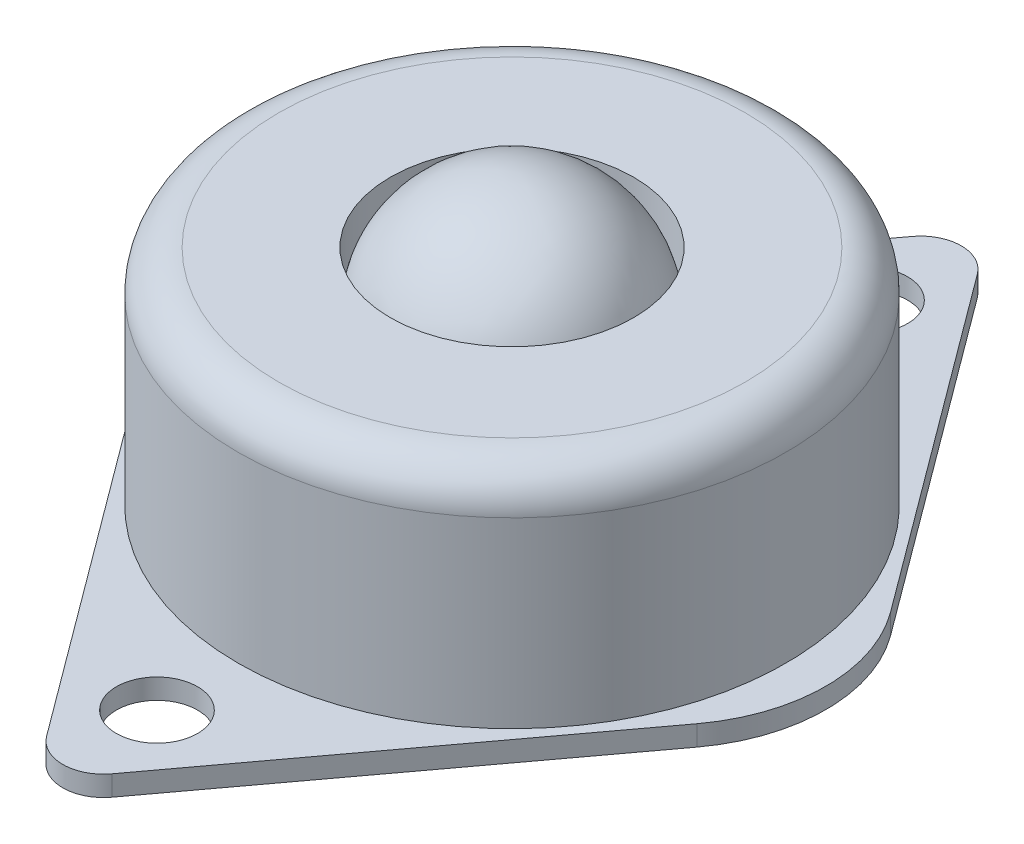
ISO-10303-21;
HEADER;
FILE_DESCRIPTION(('STEP AP214'),'2;1');
FILE_NAME('part.step','',(''),(''),'','','');
FILE_SCHEMA(('AUTOMOTIVE_DESIGN { 1 0 10303 214 1 1 1 1 }'));
ENDSEC;
DATA;
#1=APPLICATION_CONTEXT('core data for automotive mechanical design processes');
#2=APPLICATION_PROTOCOL_DEFINITION('international standard','automotive_design',2000,#1);
#3=PRODUCT_CONTEXT('',#1,'mechanical');
#4=PRODUCT('Part','Part','',(#3));
#5=PRODUCT_RELATED_PRODUCT_CATEGORY('part','',(#4));
#6=PRODUCT_DEFINITION_FORMATION('','',#4);
#7=PRODUCT_DEFINITION_CONTEXT('part definition',#1,'design');
#8=PRODUCT_DEFINITION('design','',#6,#7);
#9=PRODUCT_DEFINITION_SHAPE('','',#8);
#10=(LENGTH_UNIT() NAMED_UNIT(*) SI_UNIT(.MILLI.,.METRE.));
#11=(NAMED_UNIT(*) PLANE_ANGLE_UNIT() SI_UNIT($,.RADIAN.));
#12=(NAMED_UNIT(*) SI_UNIT($,.STERADIAN.) SOLID_ANGLE_UNIT());
#13=UNCERTAINTY_MEASURE_WITH_UNIT(LENGTH_MEASURE(1.E-05),#10,'distance_accuracy_value','');
#14=(GEOMETRIC_REPRESENTATION_CONTEXT(3) GLOBAL_UNCERTAINTY_ASSIGNED_CONTEXT((#13)) GLOBAL_UNIT_ASSIGNED_CONTEXT((#10,
#11,#12)) REPRESENTATION_CONTEXT('',''));
#15=CARTESIAN_POINT('',(0.,0.,0.));
#16=DIRECTION('',(0.,0.,1.));
#17=DIRECTION('',(1.,0.,0.));
#18=AXIS2_PLACEMENT_3D('',#15,#16,#17);
#19=CARTESIAN_POINT('',(0.,9.,0.));
#20=DIRECTION('',(-1.,0.,0.));
#21=DIRECTION('',(0.,0.,-1.));
#22=AXIS2_PLACEMENT_3D('',#19,#20,#21);
#23=SPHERICAL_SURFACE('',#22,6.);
#24=CARTESIAN_POINT('',(-6.,9.,0.));
#25=VERTEX_POINT('',#24);
#26=VERTEX_LOOP('',#25);
#27=FACE_BOUND('',#26,.T.);
#28=ADVANCED_FACE('F42',(#27),#23,.T.);
#29=CLOSED_SHELL('',(#28));
#30=MANIFOLD_SOLID_BREP('B2',#29);
#31=CARTESIAN_POINT('',(0.,10.,0.));
#32=DIRECTION('',(0.,1.,0.));
#33=DIRECTION('',(0.,0.,1.));
#34=AXIS2_PLACEMENT_3D('',#31,#32,#33);
#35=TOROIDAL_SURFACE('',#34,11.5,2.);
#36=CARTESIAN_POINT('',(0.,12.,0.));
#37=DIRECTION('',(0.,1.,0.));
#38=DIRECTION('',(0.,0.,1.));
#39=AXIS2_PLACEMENT_3D('',#36,#37,#38);
#40=CIRCLE('',#39,11.5);
#41=CARTESIAN_POINT('',(0.,12.,11.5));
#42=VERTEX_POINT('',#41);
#43=EDGE_CURVE('E65',#42,#42,#40,.T.);
#44=ORIENTED_EDGE('',*,*,#43,.F.);
#45=EDGE_LOOP('',(#44));
#46=FACE_BOUND('',#45,.T.);
#47=CARTESIAN_POINT('',(0.,10.,0.));
#48=DIRECTION('',(0.,1.,0.));
#49=DIRECTION('',(0.,0.,1.));
#50=AXIS2_PLACEMENT_3D('',#47,#48,#49);
#51=CIRCLE('',#50,13.5);
#52=CARTESIAN_POINT('',(0.,10.,13.5));
#53=VERTEX_POINT('',#52);
#54=EDGE_CURVE('E40',#53,#53,#51,.F.);
#55=ORIENTED_EDGE('',*,*,#54,.F.);
#56=EDGE_LOOP('',(#55));
#57=FACE_BOUND('',#56,.T.);
#58=ADVANCED_FACE('F57',(#46,#57),#35,.T.);
#59=CARTESIAN_POINT('',(11.2444342652969,1.,-8.34042553191489));
#60=DIRECTION('',(0.803173876092633,0.,-0.595744680851064));
#61=DIRECTION('',(-0.595744680851064,0.,-0.803173876092633));
#62=AXIS2_PLACEMENT_3D('',#59,#60,#61);
#63=PLANE('',#62);
#64=DIRECTION('',(0.595744680851064,0.,0.803173876092633));
#65=VECTOR('',#64,1.);
#66=CARTESIAN_POINT('',(11.2444342652969,0.,-8.34042553191489));
#67=LINE('',#66,#65);
#68=CARTESIAN_POINT('',(1.60634775218528,0.,-21.3343465045593));
#69=VERTEX_POINT('',#68);
#70=CARTESIAN_POINT('',(13.8957535025879,0.,-4.76595744680855));
#71=VERTEX_POINT('',#70);
#72=EDGE_CURVE('E159',#69,#71,#67,.T.);
#73=ORIENTED_EDGE('',*,*,#72,.F.);
#74=DIRECTION('',(0.,-1.,0.));
#75=VECTOR('',#74,1.);
#76=CARTESIAN_POINT('',(1.60634775218528,1.,-21.3343465045593));
#77=LINE('',#76,#75);
#78=CARTESIAN_POINT('',(1.60634775218528,1.,-21.3343465045593));
#79=VERTEX_POINT('',#78);
#80=EDGE_CURVE('E112',#79,#69,#77,.T.);
#81=ORIENTED_EDGE('',*,*,#80,.F.);
#82=DIRECTION('',(0.595744680851064,0.,0.803173876092633));
#83=VECTOR('',#82,1.);
#84=CARTESIAN_POINT('',(11.2444342652969,1.,-8.34042553191489));
#85=LINE('',#84,#83);
#86=CARTESIAN_POINT('',(13.8957535025879,1.,-4.76595744680855));
#87=VERTEX_POINT('',#86);
#88=EDGE_CURVE('E225',#79,#87,#85,.T.);
#89=ORIENTED_EDGE('',*,*,#88,.T.);
#90=DIRECTION('',(0.,-1.,0.));
#91=VECTOR('',#90,1.);
#92=CARTESIAN_POINT('',(13.8957535025879,1.,-4.76595744680855));
#93=LINE('',#92,#91);
#94=EDGE_CURVE('E108',#87,#71,#93,.T.);
#95=ORIENTED_EDGE('',*,*,#94,.T.);
#96=EDGE_LOOP('',(#73,#81,#89,#95));
#97=FACE_BOUND('',#96,.T.);
#98=ADVANCED_FACE('F207',(#97),#63,.T.);
#99=CARTESIAN_POINT('',(0.,1.,-20.1428571428571));
#100=DIRECTION('',(0.,-1.,0.));
#101=DIRECTION('',(0.,0.,-1.));
#102=AXIS2_PLACEMENT_3D('',#99,#100,#101);
#103=CYLINDRICAL_SURFACE('',#102,2.);
#104=CARTESIAN_POINT('',(0.,0.,-20.1428571428571));
#105=DIRECTION('',(0.,1.,0.));
#106=DIRECTION('',(0.,0.,1.));
#107=AXIS2_PLACEMENT_3D('',#104,#105,#106);
#108=CIRCLE('',#107,2.);
#109=CARTESIAN_POINT('',(-1.60634775218528,0.,-21.3343465045593));
#110=VERTEX_POINT('',#109);
#111=EDGE_CURVE('E163',#69,#110,#108,.T.);
#112=ORIENTED_EDGE('',*,*,#111,.T.);
#113=DIRECTION('',(0.,-1.,0.));
#114=VECTOR('',#113,1.);
#115=CARTESIAN_POINT('',(-1.60634775218528,1.,-21.3343465045593));
#116=LINE('',#115,#114);
#117=CARTESIAN_POINT('',(-1.60634775218528,1.,-21.3343465045593));
#118=VERTEX_POINT('',#117);
#119=EDGE_CURVE('E193',#118,#110,#116,.T.);
#120=ORIENTED_EDGE('',*,*,#119,.F.);
#121=CARTESIAN_POINT('',(0.,1.,-20.1428571428571));
#122=DIRECTION('',(0.,1.,0.));
#123=DIRECTION('',(0.,0.,1.));
#124=AXIS2_PLACEMENT_3D('',#121,#122,#123);
#125=CIRCLE('',#124,2.);
#126=EDGE_CURVE('E227',#79,#118,#125,.T.);
#127=ORIENTED_EDGE('',*,*,#126,.F.);
#128=ORIENTED_EDGE('',*,*,#80,.T.);
#129=EDGE_LOOP('',(#112,#120,#127,#128));
#130=FACE_BOUND('',#129,.T.);
#131=ADVANCED_FACE('F247',(#130),#103,.T.);
#132=CARTESIAN_POINT('',(-11.2444342652969,1.,-8.34042553191489));
#133=DIRECTION('',(0.803173876092633,0.,0.595744680851064));
#134=DIRECTION('',(0.595744680851064,0.,-0.803173876092633));
#135=AXIS2_PLACEMENT_3D('',#132,#133,#134);
#136=PLANE('',#135);
#137=DIRECTION('',(-0.595744680851064,0.,0.803173876092633));
#138=VECTOR('',#137,1.);
#139=CARTESIAN_POINT('',(-11.2444342652969,0.,-8.34042553191489));
#140=LINE('',#139,#138);
#141=CARTESIAN_POINT('',(-13.8957535025879,0.,-4.76595744680854));
#142=VERTEX_POINT('',#141);
#143=EDGE_CURVE('E166',#110,#142,#140,.T.);
#144=ORIENTED_EDGE('',*,*,#143,.T.);
#145=DIRECTION('',(0.,-1.,0.));
#146=VECTOR('',#145,1.);
#147=CARTESIAN_POINT('',(-13.8957535025879,1.,-4.76595744680854));
#148=LINE('',#147,#146);
#149=CARTESIAN_POINT('',(-13.8957535025879,1.,-4.76595744680854));
#150=VERTEX_POINT('',#149);
#151=EDGE_CURVE('E190',#150,#142,#148,.T.);
#152=ORIENTED_EDGE('',*,*,#151,.F.);
#153=DIRECTION('',(-0.595744680851064,0.,0.803173876092633));
#154=VECTOR('',#153,1.);
#155=CARTESIAN_POINT('',(-11.2444342652969,1.,-8.34042553191489));
#156=LINE('',#155,#154);
#157=EDGE_CURVE('E230',#118,#150,#156,.T.);
#158=ORIENTED_EDGE('',*,*,#157,.F.);
#159=ORIENTED_EDGE('',*,*,#119,.T.);
#160=EDGE_LOOP('',(#144,#152,#158,#159));
#161=FACE_BOUND('',#160,.T.);
#162=ADVANCED_FACE('F249',(#161),#136,.F.);
#163=CARTESIAN_POINT('',(-7.47036249384684,1.,0.));
#164=DIRECTION('',(0.,-1.,0.));
#165=DIRECTION('',(0.,0.,-1.));
#166=AXIS2_PLACEMENT_3D('',#163,#164,#165);
#167=CYLINDRICAL_SURFACE('',#166,8.);
#168=CARTESIAN_POINT('',(-7.47036249384684,0.,0.));
#169=DIRECTION('',(0.,1.,0.));
#170=DIRECTION('',(0.,0.,1.));
#171=AXIS2_PLACEMENT_3D('',#168,#169,#170);
#172=CIRCLE('',#171,8.);
#173=CARTESIAN_POINT('',(-13.8957535025879,0.,4.76595744680854));
#174=VERTEX_POINT('',#173);
#175=EDGE_CURVE('E169',#142,#174,#172,.T.);
#176=ORIENTED_EDGE('',*,*,#175,.T.);
#177=DIRECTION('',(0.,-1.,0.));
#178=VECTOR('',#177,1.);
#179=CARTESIAN_POINT('',(-13.8957535025879,1.,4.76595744680854));
#180=LINE('',#179,#178);
#181=CARTESIAN_POINT('',(-13.8957535025879,1.,4.76595744680854));
#182=VERTEX_POINT('',#181);
#183=EDGE_CURVE('E187',#182,#174,#180,.T.);
#184=ORIENTED_EDGE('',*,*,#183,.F.);
#185=CARTESIAN_POINT('',(-7.47036249384684,1.,0.));
#186=DIRECTION('',(0.,1.,0.));
#187=DIRECTION('',(0.,0.,1.));
#188=AXIS2_PLACEMENT_3D('',#185,#186,#187);
#189=CIRCLE('',#188,8.);
#190=EDGE_CURVE('E233',#150,#182,#189,.T.);
#191=ORIENTED_EDGE('',*,*,#190,.F.);
#192=ORIENTED_EDGE('',*,*,#151,.T.);
#193=EDGE_LOOP('',(#176,#184,#191,#192));
#194=FACE_BOUND('',#193,.T.);
#195=ADVANCED_FACE('F237',(#194),#167,.T.);
#196=CARTESIAN_POINT('',(-11.2444342652969,1.,8.34042553191489));
#197=DIRECTION('',(0.803173876092633,0.,-0.595744680851064));
#198=DIRECTION('',(-0.595744680851064,0.,-0.803173876092633));
#199=AXIS2_PLACEMENT_3D('',#196,#197,#198);
#200=PLANE('',#199);
#201=DIRECTION('',(0.595744680851064,0.,0.803173876092633));
#202=VECTOR('',#201,1.);
#203=CARTESIAN_POINT('',(-11.2444342652969,0.,8.34042553191489));
#204=LINE('',#203,#202);
#205=CARTESIAN_POINT('',(-1.60634775218528,0.,21.3343465045593));
#206=VERTEX_POINT('',#205);
#207=EDGE_CURVE('E172',#174,#206,#204,.T.);
#208=ORIENTED_EDGE('',*,*,#207,.T.);
#209=DIRECTION('',(0.,-1.,0.));
#210=VECTOR('',#209,1.);
#211=CARTESIAN_POINT('',(-1.60634775218528,1.,21.3343465045593));
#212=LINE('',#211,#210);
#213=CARTESIAN_POINT('',(-1.60634775218528,1.,21.3343465045593));
#214=VERTEX_POINT('',#213);
#215=EDGE_CURVE('E146',#214,#206,#212,.T.);
#216=ORIENTED_EDGE('',*,*,#215,.F.);
#217=DIRECTION('',(0.595744680851064,0.,0.803173876092633));
#218=VECTOR('',#217,1.);
#219=CARTESIAN_POINT('',(-11.2444342652969,1.,8.34042553191489));
#220=LINE('',#219,#218);
#221=EDGE_CURVE('E134',#182,#214,#220,.T.);
#222=ORIENTED_EDGE('',*,*,#221,.F.);
#223=ORIENTED_EDGE('',*,*,#183,.T.);
#224=EDGE_LOOP('',(#208,#216,#222,#223));
#225=FACE_BOUND('',#224,.T.);
#226=ADVANCED_FACE('F239',(#225),#200,.F.);
#227=CARTESIAN_POINT('',(0.,1.,20.1428571428571));
#228=DIRECTION('',(0.,-1.,0.));
#229=DIRECTION('',(0.,0.,-1.));
#230=AXIS2_PLACEMENT_3D('',#227,#228,#229);
#231=CYLINDRICAL_SURFACE('',#230,2.);
#232=CARTESIAN_POINT('',(0.,0.,20.1428571428571));
#233=DIRECTION('',(0.,1.,0.));
#234=DIRECTION('',(0.,0.,1.));
#235=AXIS2_PLACEMENT_3D('',#232,#233,#234);
#236=CIRCLE('',#235,2.);
#237=CARTESIAN_POINT('',(1.60634775218528,0.,21.3343465045593));
#238=VERTEX_POINT('',#237);
#239=EDGE_CURVE('E142',#206,#238,#236,.T.);
#240=ORIENTED_EDGE('',*,*,#239,.T.);
#241=DIRECTION('',(0.,-1.,0.));
#242=VECTOR('',#241,1.);
#243=CARTESIAN_POINT('',(1.60634775218528,1.,21.3343465045593));
#244=LINE('',#243,#242);
#245=CARTESIAN_POINT('',(1.60634775218528,1.,21.3343465045593));
#246=VERTEX_POINT('',#245);
#247=EDGE_CURVE('E140',#246,#238,#244,.T.);
#248=ORIENTED_EDGE('',*,*,#247,.F.);
#249=CARTESIAN_POINT('',(0.,1.,20.1428571428571));
#250=DIRECTION('',(0.,1.,0.));
#251=DIRECTION('',(0.,0.,1.));
#252=AXIS2_PLACEMENT_3D('',#249,#250,#251);
#253=CIRCLE('',#252,2.);
#254=EDGE_CURVE('E127',#214,#246,#253,.T.);
#255=ORIENTED_EDGE('',*,*,#254,.F.);
#256=ORIENTED_EDGE('',*,*,#215,.T.);
#257=EDGE_LOOP('',(#240,#248,#255,#256));
#258=FACE_BOUND('',#257,.T.);
#259=ADVANCED_FACE('F141',(#258),#231,.T.);
#260=CARTESIAN_POINT('',(11.2444342652969,1.,8.34042553191488));
#261=DIRECTION('',(0.803173876092633,0.,0.595744680851063));
#262=DIRECTION('',(0.595744680851063,0.,-0.803173876092633));
#263=AXIS2_PLACEMENT_3D('',#260,#261,#262);
#264=PLANE('',#263);
#265=DIRECTION('',(-0.595744680851063,0.,0.803173876092633));
#266=VECTOR('',#265,1.);
#267=CARTESIAN_POINT('',(11.2444342652969,0.,8.34042553191488));
#268=LINE('',#267,#266);
#269=CARTESIAN_POINT('',(13.8957535025879,0.,4.76595744680854));
#270=VERTEX_POINT('',#269);
#271=EDGE_CURVE('E176',#270,#238,#268,.T.);
#272=ORIENTED_EDGE('',*,*,#271,.F.);
#273=DIRECTION('',(0.,-1.,0.));
#274=VECTOR('',#273,1.);
#275=CARTESIAN_POINT('',(13.8957535025879,1.,4.76595744680854));
#276=LINE('',#275,#274);
#277=CARTESIAN_POINT('',(13.8957535025879,1.,4.76595744680854));
#278=VERTEX_POINT('',#277);
#279=EDGE_CURVE('E101',#278,#270,#276,.T.);
#280=ORIENTED_EDGE('',*,*,#279,.F.);
#281=DIRECTION('',(-0.595744680851063,0.,0.803173876092633));
#282=VECTOR('',#281,1.);
#283=CARTESIAN_POINT('',(11.2444342652969,1.,8.34042553191488));
#284=LINE('',#283,#282);
#285=EDGE_CURVE('E132',#278,#246,#284,.T.);
#286=ORIENTED_EDGE('',*,*,#285,.T.);
#287=ORIENTED_EDGE('',*,*,#247,.T.);
#288=EDGE_LOOP('',(#272,#280,#286,#287));
#289=FACE_BOUND('',#288,.T.);
#290=ADVANCED_FACE('F148',(#289),#264,.T.);
#291=CARTESIAN_POINT('',(7.47036249384684,1.,0.));
#292=DIRECTION('',(0.,-1.,0.));
#293=DIRECTION('',(0.,0.,-1.));
#294=AXIS2_PLACEMENT_3D('',#291,#292,#293);
#295=CYLINDRICAL_SURFACE('',#294,8.);
#296=CARTESIAN_POINT('',(7.47036249384684,0.,0.));
#297=DIRECTION('',(0.,1.,0.));
#298=DIRECTION('',(0.,0.,1.));
#299=AXIS2_PLACEMENT_3D('',#296,#297,#298);
#300=CIRCLE('',#299,8.);
#301=EDGE_CURVE('E178',#270,#71,#300,.T.);
#302=ORIENTED_EDGE('',*,*,#301,.T.);
#303=ORIENTED_EDGE('',*,*,#94,.F.);
#304=CARTESIAN_POINT('',(7.47036249384684,1.,0.));
#305=DIRECTION('',(0.,1.,0.));
#306=DIRECTION('',(0.,0.,1.));
#307=AXIS2_PLACEMENT_3D('',#304,#305,#306);
#308=CIRCLE('',#307,8.);
#309=EDGE_CURVE('E73',#278,#87,#308,.T.);
#310=ORIENTED_EDGE('',*,*,#309,.F.);
#311=ORIENTED_EDGE('',*,*,#279,.T.);
#312=EDGE_LOOP('',(#302,#303,#310,#311));
#313=FACE_BOUND('',#312,.T.);
#314=ADVANCED_FACE('F244',(#313),#295,.T.);
#315=CARTESIAN_POINT('',(0.,1.,-17.5));
#316=DIRECTION('',(0.,-1.,0.));
#317=DIRECTION('',(0.,0.,-1.));
#318=AXIS2_PLACEMENT_3D('',#315,#316,#317);
#319=CYLINDRICAL_SURFACE('',#318,2.);
#320=CARTESIAN_POINT('',(0.,1.,-17.5));
#321=DIRECTION('',(0.,1.,0.));
#322=DIRECTION('',(0.,0.,1.));
#323=AXIS2_PLACEMENT_3D('',#320,#321,#322);
#324=CIRCLE('',#323,2.);
#325=CARTESIAN_POINT('',(0.,1.,-15.5));
#326=VERTEX_POINT('',#325);
#327=EDGE_CURVE('E183',#326,#326,#324,.T.);
#328=ORIENTED_EDGE('',*,*,#327,.T.);
#329=EDGE_LOOP('',(#328));
#330=FACE_BOUND('',#329,.T.);
#331=CARTESIAN_POINT('',(0.,0.,-17.5));
#332=DIRECTION('',(0.,1.,0.));
#333=DIRECTION('',(0.,0.,1.));
#334=AXIS2_PLACEMENT_3D('',#331,#332,#333);
#335=CIRCLE('',#334,2.);
#336=CARTESIAN_POINT('',(0.,0.,-15.5));
#337=VERTEX_POINT('',#336);
#338=EDGE_CURVE('E156',#337,#337,#335,.T.);
#339=ORIENTED_EDGE('',*,*,#338,.F.);
#340=EDGE_LOOP('',(#339));
#341=FACE_BOUND('',#340,.T.);
#342=ADVANCED_FACE('F261',(#330,#341),#319,.F.);
#343=CARTESIAN_POINT('',(0.,1.,17.5));
#344=DIRECTION('',(0.,-1.,0.));
#345=DIRECTION('',(0.,0.,-1.));
#346=AXIS2_PLACEMENT_3D('',#343,#344,#345);
#347=CYLINDRICAL_SURFACE('',#346,2.);
#348=CARTESIAN_POINT('',(0.,1.,17.5));
#349=DIRECTION('',(0.,1.,0.));
#350=DIRECTION('',(0.,0.,1.));
#351=AXIS2_PLACEMENT_3D('',#348,#349,#350);
#352=CIRCLE('',#351,2.);
#353=CARTESIAN_POINT('',(0.,1.,19.5));
#354=VERTEX_POINT('',#353);
#355=EDGE_CURVE('E150',#354,#354,#352,.F.);
#356=ORIENTED_EDGE('',*,*,#355,.F.);
#357=EDGE_LOOP('',(#356));
#358=FACE_BOUND('',#357,.T.);
#359=CARTESIAN_POINT('',(0.,0.,17.5));
#360=DIRECTION('',(0.,1.,0.));
#361=DIRECTION('',(0.,0.,1.));
#362=AXIS2_PLACEMENT_3D('',#359,#360,#361);
#363=CIRCLE('',#362,2.);
#364=CARTESIAN_POINT('',(0.,0.,19.5));
#365=VERTEX_POINT('',#364);
#366=EDGE_CURVE('E180',#365,#365,#363,.F.);
#367=ORIENTED_EDGE('',*,*,#366,.T.);
#368=EDGE_LOOP('',(#367));
#369=FACE_BOUND('',#368,.T.);
#370=ADVANCED_FACE('F263',(#358,#369),#347,.F.);
#371=CARTESIAN_POINT('',(0.,1.,0.));
#372=DIRECTION('',(0.,1.,0.));
#373=DIRECTION('',(0.,0.,1.));
#374=AXIS2_PLACEMENT_3D('',#371,#372,#373);
#375=PLANE('',#374);
#376=CARTESIAN_POINT('',(0.,1.,0.));
#377=DIRECTION('',(0.,1.,0.));
#378=DIRECTION('',(0.,0.,1.));
#379=AXIS2_PLACEMENT_3D('',#376,#377,#378);
#380=CIRCLE('',#379,13.5);
#381=CARTESIAN_POINT('',(0.,1.,13.5));
#382=VERTEX_POINT('',#381);
#383=EDGE_CURVE('E217',#382,#382,#380,.T.);
#384=ORIENTED_EDGE('',*,*,#383,.F.);
#385=EDGE_LOOP('',(#384));
#386=FACE_BOUND('',#385,.T.);
#387=ORIENTED_EDGE('',*,*,#327,.F.);
#388=EDGE_LOOP('',(#387));
#389=FACE_BOUND('',#388,.T.);
#390=ORIENTED_EDGE('',*,*,#88,.F.);
#391=ORIENTED_EDGE('',*,*,#126,.T.);
#392=ORIENTED_EDGE('',*,*,#157,.T.);
#393=ORIENTED_EDGE('',*,*,#190,.T.);
#394=ORIENTED_EDGE('',*,*,#221,.T.);
#395=ORIENTED_EDGE('',*,*,#254,.T.);
#396=ORIENTED_EDGE('',*,*,#285,.F.);
#397=ORIENTED_EDGE('',*,*,#309,.T.);
#398=EDGE_LOOP('',(#390,#391,#392,#393,#394,#395,#396,#397));
#399=FACE_BOUND('',#398,.T.);
#400=ORIENTED_EDGE('',*,*,#355,.T.);
#401=EDGE_LOOP('',(#400));
#402=FACE_BOUND('',#401,.T.);
#403=ADVANCED_FACE('F129',(#386,#389,#399,#402),#375,.T.);
#404=CARTESIAN_POINT('',(0.,0.,0.));
#405=DIRECTION('',(0.,1.,0.));
#406=DIRECTION('',(0.,0.,1.));
#407=AXIS2_PLACEMENT_3D('',#404,#405,#406);
#408=PLANE('',#407);
#409=ORIENTED_EDGE('',*,*,#338,.T.);
#410=EDGE_LOOP('',(#409));
#411=FACE_BOUND('',#410,.T.);
#412=ORIENTED_EDGE('',*,*,#72,.T.);
#413=ORIENTED_EDGE('',*,*,#301,.F.);
#414=ORIENTED_EDGE('',*,*,#271,.T.);
#415=ORIENTED_EDGE('',*,*,#239,.F.);
#416=ORIENTED_EDGE('',*,*,#207,.F.);
#417=ORIENTED_EDGE('',*,*,#175,.F.);
#418=ORIENTED_EDGE('',*,*,#143,.F.);
#419=ORIENTED_EDGE('',*,*,#111,.F.);
#420=EDGE_LOOP('',(#412,#413,#414,#415,#416,#417,#418,#419));
#421=FACE_BOUND('',#420,.T.);
#422=ORIENTED_EDGE('',*,*,#366,.F.);
#423=EDGE_LOOP('',(#422));
#424=FACE_BOUND('',#423,.T.);
#425=ADVANCED_FACE('F241',(#411,#421,#424),#408,.F.);
#426=CARTESIAN_POINT('',(0.,12.,0.));
#427=DIRECTION('',(0.,-1.,0.));
#428=DIRECTION('',(0.,0.,-1.));
#429=AXIS2_PLACEMENT_3D('',#426,#427,#428);
#430=CYLINDRICAL_SURFACE('',#429,6.);
#431=CARTESIAN_POINT('',(0.,1.,0.));
#432=DIRECTION('',(0.,1.,0.));
#433=DIRECTION('',(0.,0.,1.));
#434=AXIS2_PLACEMENT_3D('',#431,#432,#433);
#435=CIRCLE('',#434,6.);
#436=CARTESIAN_POINT('',(0.,1.,6.));
#437=VERTEX_POINT('',#436);
#438=EDGE_CURVE('E197',#437,#437,#435,.F.);
#439=ORIENTED_EDGE('',*,*,#438,.T.);
#440=EDGE_LOOP('',(#439));
#441=FACE_BOUND('',#440,.T.);
#442=CARTESIAN_POINT('',(0.,12.,0.));
#443=DIRECTION('',(0.,1.,0.));
#444=DIRECTION('',(0.,0.,1.));
#445=AXIS2_PLACEMENT_3D('',#442,#443,#444);
#446=CIRCLE('',#445,6.);
#447=CARTESIAN_POINT('',(0.,12.,6.));
#448=VERTEX_POINT('',#447);
#449=EDGE_CURVE('E160',#448,#448,#446,.T.);
#450=ORIENTED_EDGE('',*,*,#449,.T.);
#451=EDGE_LOOP('',(#450));
#452=FACE_BOUND('',#451,.T.);
#453=ADVANCED_FACE('F213',(#441,#452),#430,.F.);
#454=CARTESIAN_POINT('',(0.,12.,0.));
#455=DIRECTION('',(0.,-1.,0.));
#456=DIRECTION('',(0.,0.,-1.));
#457=AXIS2_PLACEMENT_3D('',#454,#455,#456);
#458=CYLINDRICAL_SURFACE('',#457,13.5);
#459=ORIENTED_EDGE('',*,*,#54,.T.);
#460=EDGE_LOOP('',(#459));
#461=FACE_BOUND('',#460,.T.);
#462=ORIENTED_EDGE('',*,*,#383,.T.);
#463=EDGE_LOOP('',(#462));
#464=FACE_BOUND('',#463,.T.);
#465=ADVANCED_FACE('F210',(#461,#464),#458,.T.);
#466=CARTESIAN_POINT('',(0.,12.,0.));
#467=DIRECTION('',(0.,1.,0.));
#468=DIRECTION('',(0.,0.,1.));
#469=AXIS2_PLACEMENT_3D('',#466,#467,#468);
#470=PLANE('',#469);
#471=ORIENTED_EDGE('',*,*,#43,.T.);
#472=EDGE_LOOP('',(#471));
#473=FACE_BOUND('',#472,.T.);
#474=ORIENTED_EDGE('',*,*,#449,.F.);
#475=EDGE_LOOP('',(#474));
#476=FACE_BOUND('',#475,.T.);
#477=ADVANCED_FACE('F202',(#473,#476),#470,.T.);
#478=ORIENTED_EDGE('',*,*,#438,.F.);
#479=EDGE_LOOP('',(#478));
#480=FACE_BOUND('',#479,.T.);
#481=ADVANCED_FACE('F285',(#480),#375,.T.);
#482=CLOSED_SHELL('',(#58,#98,#131,#162,#195,#226,#259,#290,#314,#342,#370,#403,#425,#453,#465,
#477,#481));
#483=MANIFOLD_SOLID_BREP('B6',#482);
#484=ADVANCED_BREP_SHAPE_REPRESENTATION('',(#18,#30,#483),#14);
#485=SHAPE_DEFINITION_REPRESENTATION(#9,#484);
ENDSEC;
END-ISO-10303-21;
